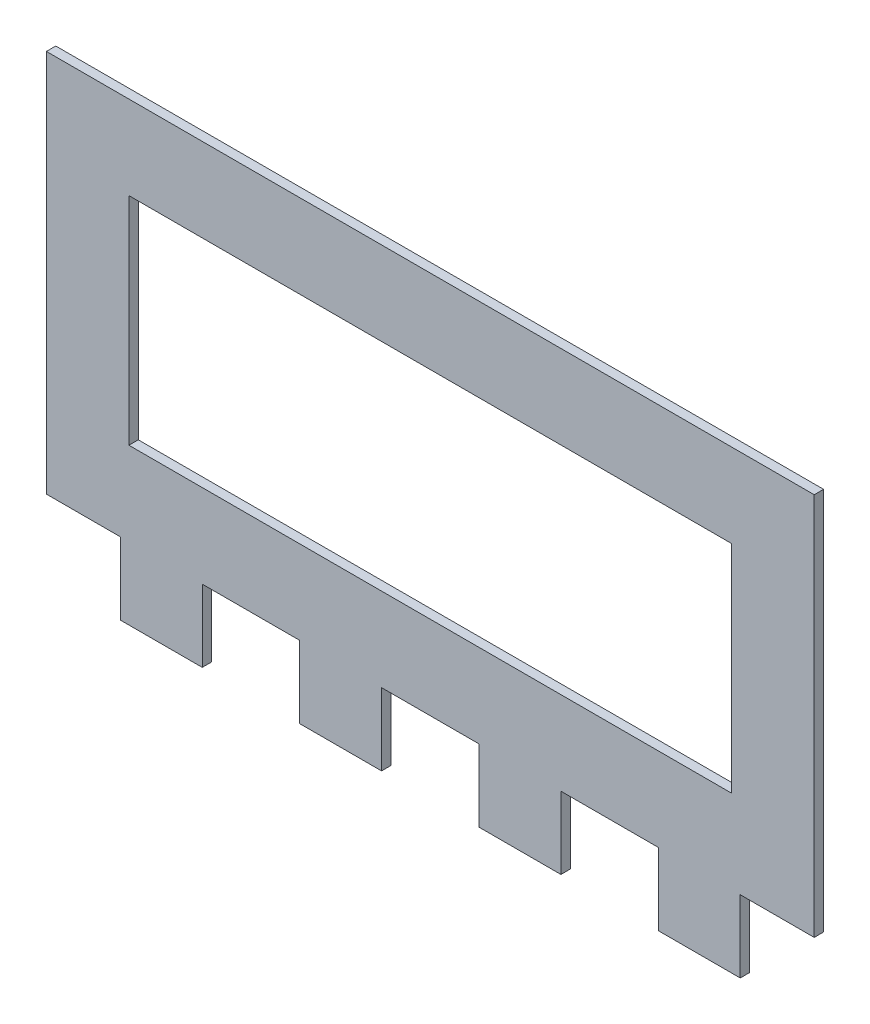
ISO-10303-21;
HEADER;
FILE_DESCRIPTION(('STEP AP214'),'2;1');
FILE_NAME('part.step','',(''),(''),'','','');
FILE_SCHEMA(('AUTOMOTIVE_DESIGN { 1 0 10303 214 1 1 1 1 }'));
ENDSEC;
DATA;
#1=APPLICATION_CONTEXT('core data for automotive mechanical design processes');
#2=APPLICATION_PROTOCOL_DEFINITION('international standard','automotive_design',2000,#1);
#3=PRODUCT_CONTEXT('',#1,'mechanical');
#4=PRODUCT('Part','Part','',(#3));
#5=PRODUCT_RELATED_PRODUCT_CATEGORY('part','',(#4));
#6=PRODUCT_DEFINITION_FORMATION('','',#4);
#7=PRODUCT_DEFINITION_CONTEXT('part definition',#1,'design');
#8=PRODUCT_DEFINITION('design','',#6,#7);
#9=PRODUCT_DEFINITION_SHAPE('','',#8);
#10=(LENGTH_UNIT() NAMED_UNIT(*) SI_UNIT(.MILLI.,.METRE.));
#11=(NAMED_UNIT(*) PLANE_ANGLE_UNIT() SI_UNIT($,.RADIAN.));
#12=(NAMED_UNIT(*) SI_UNIT($,.STERADIAN.) SOLID_ANGLE_UNIT());
#13=UNCERTAINTY_MEASURE_WITH_UNIT(LENGTH_MEASURE(1.E-05),#10,'distance_accuracy_value','');
#14=(GEOMETRIC_REPRESENTATION_CONTEXT(3) GLOBAL_UNCERTAINTY_ASSIGNED_CONTEXT((#13)) GLOBAL_UNIT_ASSIGNED_CONTEXT((#10,
#11,#12)) REPRESENTATION_CONTEXT('',''));
#15=CARTESIAN_POINT('',(0.,0.,0.));
#16=DIRECTION('',(0.,0.,1.));
#17=DIRECTION('',(1.,0.,0.));
#18=AXIS2_PLACEMENT_3D('',#15,#16,#17);
#19=CARTESIAN_POINT('',(0.299292489422655,-0.628720919475011,0.));
#20=DIRECTION('',(-1.,0.,0.));
#21=DIRECTION('',(0.,-1.,0.));
#22=AXIS2_PLACEMENT_3D('',#19,#20,#21);
#23=PLANE('',#22);
#24=DIRECTION('',(0.,-1.,0.));
#25=VECTOR('',#24,1.);
#26=CARTESIAN_POINT('',(0.299292489422655,-0.628720919475011,0.));
#27=LINE('',#26,#25);
#28=CARTESIAN_POINT('',(0.299292489422655,-0.628720919475011,0.));
#29=VERTEX_POINT('',#28);
#30=CARTESIAN_POINT('',(0.299292489422655,-0.697929145402712,0.));
#31=VERTEX_POINT('',#30);
#32=EDGE_CURVE('E11',#29,#31,#27,.T.);
#33=ORIENTED_EDGE('',*,*,#32,.T.);
#34=DIRECTION('',(0.,0.,1.));
#35=VECTOR('',#34,1.);
#36=CARTESIAN_POINT('',(0.299292489422655,-0.697929145402712,0.));
#37=LINE('',#36,#35);
#38=CARTESIAN_POINT('',(0.299292489422655,-0.697929145402712,0.003));
#39=VERTEX_POINT('',#38);
#40=EDGE_CURVE('E24',#31,#39,#37,.T.);
#41=ORIENTED_EDGE('',*,*,#40,.T.);
#42=DIRECTION('',(0.,-1.,0.));
#43=VECTOR('',#42,1.);
#44=CARTESIAN_POINT('',(0.299292489422655,-0.628720919475011,0.003));
#45=LINE('',#44,#43);
#46=CARTESIAN_POINT('',(0.299292489422655,-0.628720919475011,0.003));
#47=VERTEX_POINT('',#46);
#48=EDGE_CURVE('E388',#47,#39,#45,.T.);
#49=ORIENTED_EDGE('',*,*,#48,.F.);
#50=DIRECTION('',(0.,0.,1.));
#51=VECTOR('',#50,1.);
#52=CARTESIAN_POINT('',(0.299292489422655,-0.628720919475011,0.));
#53=LINE('',#52,#51);
#54=EDGE_CURVE('E385',#29,#47,#53,.T.);
#55=ORIENTED_EDGE('',*,*,#54,.F.);
#56=EDGE_LOOP('',(#33,#41,#49,#55));
#57=FACE_BOUND('',#56,.T.);
#58=ADVANCED_FACE('F17',(#57),#23,.T.);
#59=CARTESIAN_POINT('',(0.106314885062331,-0.628720919475011,0.));
#60=DIRECTION('',(0.,-1.,0.));
#61=DIRECTION('',(1.,0.,0.));
#62=AXIS2_PLACEMENT_3D('',#59,#60,#61);
#63=PLANE('',#62);
#64=DIRECTION('',(1.,0.,0.));
#65=VECTOR('',#64,1.);
#66=CARTESIAN_POINT('',(0.106314885062331,-0.628720919475011,0.));
#67=LINE('',#66,#65);
#68=CARTESIAN_POINT('',(0.106314885062331,-0.628720919475011,0.));
#69=VERTEX_POINT('',#68);
#70=EDGE_CURVE('E382',#69,#29,#67,.T.);
#71=ORIENTED_EDGE('',*,*,#70,.T.);
#72=ORIENTED_EDGE('',*,*,#54,.T.);
#73=DIRECTION('',(1.,0.,0.));
#74=VECTOR('',#73,1.);
#75=CARTESIAN_POINT('',(0.106314885062331,-0.628720919475011,0.003));
#76=LINE('',#75,#74);
#77=CARTESIAN_POINT('',(0.106314885062331,-0.628720919475011,0.003));
#78=VERTEX_POINT('',#77);
#79=EDGE_CURVE('E379',#78,#47,#76,.T.);
#80=ORIENTED_EDGE('',*,*,#79,.F.);
#81=DIRECTION('',(0.,0.,1.));
#82=VECTOR('',#81,1.);
#83=CARTESIAN_POINT('',(0.106314885062331,-0.628720919475011,0.));
#84=LINE('',#83,#82);
#85=EDGE_CURVE('E376',#69,#78,#84,.T.);
#86=ORIENTED_EDGE('',*,*,#85,.F.);
#87=EDGE_LOOP('',(#71,#72,#80,#86));
#88=FACE_BOUND('',#87,.T.);
#89=ADVANCED_FACE('F398',(#88),#63,.T.);
#90=CARTESIAN_POINT('',(0.106314885062331,-0.697929145402712,0.));
#91=DIRECTION('',(1.,0.,0.));
#92=DIRECTION('',(0.,1.,0.));
#93=AXIS2_PLACEMENT_3D('',#90,#91,#92);
#94=PLANE('',#93);
#95=DIRECTION('',(0.,1.,0.));
#96=VECTOR('',#95,1.);
#97=CARTESIAN_POINT('',(0.106314885062331,-0.697929145402712,0.));
#98=LINE('',#97,#96);
#99=CARTESIAN_POINT('',(0.106314885062331,-0.697929145402712,0.));
#100=VERTEX_POINT('',#99);
#101=EDGE_CURVE('E373',#100,#69,#98,.T.);
#102=ORIENTED_EDGE('',*,*,#101,.T.);
#103=ORIENTED_EDGE('',*,*,#85,.T.);
#104=DIRECTION('',(0.,1.,0.));
#105=VECTOR('',#104,1.);
#106=CARTESIAN_POINT('',(0.106314885062331,-0.697929145402712,0.003));
#107=LINE('',#106,#105);
#108=CARTESIAN_POINT('',(0.106314885062331,-0.697929145402712,0.003));
#109=VERTEX_POINT('',#108);
#110=EDGE_CURVE('E370',#109,#78,#107,.T.);
#111=ORIENTED_EDGE('',*,*,#110,.F.);
#112=DIRECTION('',(0.,0.,1.));
#113=VECTOR('',#112,1.);
#114=CARTESIAN_POINT('',(0.106314885062331,-0.697929145402712,0.));
#115=LINE('',#114,#113);
#116=EDGE_CURVE('E367',#100,#109,#115,.T.);
#117=ORIENTED_EDGE('',*,*,#116,.F.);
#118=EDGE_LOOP('',(#102,#103,#111,#117));
#119=FACE_BOUND('',#118,.T.);
#120=ADVANCED_FACE('F395',(#119),#94,.T.);
#121=CARTESIAN_POINT('',(0.299292489422655,-0.697929145402712,0.));
#122=DIRECTION('',(0.,1.,0.));
#123=DIRECTION('',(-1.,0.,0.));
#124=AXIS2_PLACEMENT_3D('',#121,#122,#123);
#125=PLANE('',#124);
#126=DIRECTION('',(-1.,0.,0.));
#127=VECTOR('',#126,1.);
#128=CARTESIAN_POINT('',(0.299292489422655,-0.697929145402712,0.));
#129=LINE('',#128,#127);
#130=EDGE_CURVE('E364',#31,#100,#129,.T.);
#131=ORIENTED_EDGE('',*,*,#130,.T.);
#132=ORIENTED_EDGE('',*,*,#116,.T.);
#133=DIRECTION('',(-1.,0.,0.));
#134=VECTOR('',#133,1.);
#135=CARTESIAN_POINT('',(0.299292489422655,-0.697929145402712,0.003));
#136=LINE('',#135,#134);
#137=EDGE_CURVE('E361',#39,#109,#136,.T.);
#138=ORIENTED_EDGE('',*,*,#137,.F.);
#139=ORIENTED_EDGE('',*,*,#40,.F.);
#140=EDGE_LOOP('',(#131,#132,#138,#139));
#141=FACE_BOUND('',#140,.T.);
#142=ADVANCED_FACE('F392',(#141),#125,.T.);
#143=CARTESIAN_POINT('',(0.129796845879691,-0.747783760491294,0.));
#144=DIRECTION('',(1.,0.,0.));
#145=DIRECTION('',(0.,1.,0.));
#146=AXIS2_PLACEMENT_3D('',#143,#144,#145);
#147=PLANE('',#146);
#148=DIRECTION('',(0.,1.,0.));
#149=VECTOR('',#148,1.);
#150=CARTESIAN_POINT('',(0.129796845879691,-0.747783760491294,0.));
#151=LINE('',#150,#149);
#152=CARTESIAN_POINT('',(0.129796845879691,-0.747783760491294,0.));
#153=VERTEX_POINT('',#152);
#154=CARTESIAN_POINT('',(0.129796845879691,-0.724695760491296,0.));
#155=VERTEX_POINT('',#154);
#156=EDGE_CURVE('E359',#153,#155,#151,.T.);
#157=ORIENTED_EDGE('',*,*,#156,.T.);
#158=DIRECTION('',(0.,0.,1.));
#159=VECTOR('',#158,1.);
#160=CARTESIAN_POINT('',(0.129796845879691,-0.724695760491296,0.));
#161=LINE('',#160,#159);
#162=CARTESIAN_POINT('',(0.129796845879691,-0.724695760491296,0.003));
#163=VERTEX_POINT('',#162);
#164=EDGE_CURVE('E357',#155,#163,#161,.T.);
#165=ORIENTED_EDGE('',*,*,#164,.T.);
#166=DIRECTION('',(0.,1.,0.));
#167=VECTOR('',#166,1.);
#168=CARTESIAN_POINT('',(0.129796845879691,-0.747783760491294,0.003));
#169=LINE('',#168,#167);
#170=CARTESIAN_POINT('',(0.129796845879691,-0.747783760491294,0.003));
#171=VERTEX_POINT('',#170);
#172=EDGE_CURVE('E199',#171,#163,#169,.T.);
#173=ORIENTED_EDGE('',*,*,#172,.F.);
#174=DIRECTION('',(0.,0.,1.));
#175=VECTOR('',#174,1.);
#176=CARTESIAN_POINT('',(0.129796845879691,-0.747783760491294,0.));
#177=LINE('',#176,#175);
#178=EDGE_CURVE('E353',#153,#171,#177,.T.);
#179=ORIENTED_EDGE('',*,*,#178,.F.);
#180=EDGE_LOOP('',(#157,#165,#173,#179));
#181=FACE_BOUND('',#180,.T.);
#182=ADVANCED_FACE('F419',(#181),#147,.T.);
#183=CARTESIAN_POINT('',(0.103586528605295,-0.747783760491294,0.));
#184=DIRECTION('',(0.,-1.,0.));
#185=DIRECTION('',(1.,0.,0.));
#186=AXIS2_PLACEMENT_3D('',#183,#184,#185);
#187=PLANE('',#186);
#188=DIRECTION('',(1.,0.,0.));
#189=VECTOR('',#188,1.);
#190=CARTESIAN_POINT('',(0.103586528605295,-0.747783760491294,0.));
#191=LINE('',#190,#189);
#192=CARTESIAN_POINT('',(0.103586528605295,-0.747783760491294,0.));
#193=VERTEX_POINT('',#192);
#194=EDGE_CURVE('E350',#193,#153,#191,.T.);
#195=ORIENTED_EDGE('',*,*,#194,.T.);
#196=ORIENTED_EDGE('',*,*,#178,.T.);
#197=DIRECTION('',(1.,0.,0.));
#198=VECTOR('',#197,1.);
#199=CARTESIAN_POINT('',(0.103586528605295,-0.747783760491294,0.003));
#200=LINE('',#199,#198);
#201=CARTESIAN_POINT('',(0.103586528605295,-0.747783760491294,0.003));
#202=VERTEX_POINT('',#201);
#203=EDGE_CURVE('E348',#202,#171,#200,.T.);
#204=ORIENTED_EDGE('',*,*,#203,.F.);
#205=DIRECTION('',(0.,0.,1.));
#206=VECTOR('',#205,1.);
#207=CARTESIAN_POINT('',(0.103586528605295,-0.747783760491294,0.));
#208=LINE('',#207,#206);
#209=EDGE_CURVE('E345',#193,#202,#208,.T.);
#210=ORIENTED_EDGE('',*,*,#209,.F.);
#211=EDGE_LOOP('',(#195,#196,#204,#210));
#212=FACE_BOUND('',#211,.T.);
#213=ADVANCED_FACE('F422',(#212),#187,.T.);
#214=CARTESIAN_POINT('',(0.103586528605295,-0.724695760491296,0.));
#215=DIRECTION('',(-1.,0.,0.));
#216=DIRECTION('',(0.,-1.,0.));
#217=AXIS2_PLACEMENT_3D('',#214,#215,#216);
#218=PLANE('',#217);
#219=DIRECTION('',(0.,-1.,0.));
#220=VECTOR('',#219,1.);
#221=CARTESIAN_POINT('',(0.103586528605295,-0.724695760491296,0.));
#222=LINE('',#221,#220);
#223=CARTESIAN_POINT('',(0.103586528605295,-0.724695760491296,0.));
#224=VERTEX_POINT('',#223);
#225=EDGE_CURVE('E342',#224,#193,#222,.T.);
#226=ORIENTED_EDGE('',*,*,#225,.T.);
#227=ORIENTED_EDGE('',*,*,#209,.T.);
#228=DIRECTION('',(0.,-1.,0.));
#229=VECTOR('',#228,1.);
#230=CARTESIAN_POINT('',(0.103586528605295,-0.724695760491296,0.003));
#231=LINE('',#230,#229);
#232=CARTESIAN_POINT('',(0.103586528605295,-0.724695760491296,0.003));
#233=VERTEX_POINT('',#232);
#234=EDGE_CURVE('E339',#233,#202,#231,.T.);
#235=ORIENTED_EDGE('',*,*,#234,.F.);
#236=DIRECTION('',(0.,0.,1.));
#237=VECTOR('',#236,1.);
#238=CARTESIAN_POINT('',(0.103586528605295,-0.724695760491296,0.));
#239=LINE('',#238,#237);
#240=EDGE_CURVE('E336',#224,#233,#239,.T.);
#241=ORIENTED_EDGE('',*,*,#240,.F.);
#242=EDGE_LOOP('',(#226,#227,#235,#241));
#243=FACE_BOUND('',#242,.T.);
#244=ADVANCED_FACE('F426',(#243),#218,.T.);
#245=CARTESIAN_POINT('',(0.0799016084450542,-0.724695760491296,0.));
#246=DIRECTION('',(0.,-1.,0.));
#247=DIRECTION('',(1.,0.,0.));
#248=AXIS2_PLACEMENT_3D('',#245,#246,#247);
#249=PLANE('',#248);
#250=DIRECTION('',(1.,0.,0.));
#251=VECTOR('',#250,1.);
#252=CARTESIAN_POINT('',(0.0799016084450542,-0.724695760491296,0.));
#253=LINE('',#252,#251);
#254=CARTESIAN_POINT('',(0.0799016084450542,-0.724695760491296,0.));
#255=VERTEX_POINT('',#254);
#256=EDGE_CURVE('E333',#255,#224,#253,.T.);
#257=ORIENTED_EDGE('',*,*,#256,.T.);
#258=ORIENTED_EDGE('',*,*,#240,.T.);
#259=DIRECTION('',(1.,0.,0.));
#260=VECTOR('',#259,1.);
#261=CARTESIAN_POINT('',(0.0799016084450542,-0.724695760491296,0.003));
#262=LINE('',#261,#260);
#263=CARTESIAN_POINT('',(0.0799016084450542,-0.724695760491296,0.003));
#264=VERTEX_POINT('',#263);
#265=EDGE_CURVE('E330',#264,#233,#262,.T.);
#266=ORIENTED_EDGE('',*,*,#265,.F.);
#267=DIRECTION('',(0.,0.,1.));
#268=VECTOR('',#267,1.);
#269=CARTESIAN_POINT('',(0.0799016084450542,-0.724695760491296,0.));
#270=LINE('',#269,#268);
#271=EDGE_CURVE('E327',#255,#264,#270,.T.);
#272=ORIENTED_EDGE('',*,*,#271,.F.);
#273=EDGE_LOOP('',(#257,#258,#266,#272));
#274=FACE_BOUND('',#273,.T.);
#275=ADVANCED_FACE('F430',(#274),#249,.T.);
#276=CARTESIAN_POINT('',(0.0799016084450542,-0.601954304386427,0.));
#277=DIRECTION('',(-1.,0.,0.));
#278=DIRECTION('',(0.,-1.,0.));
#279=AXIS2_PLACEMENT_3D('',#276,#277,#278);
#280=PLANE('',#279);
#281=DIRECTION('',(0.,-1.,0.));
#282=VECTOR('',#281,1.);
#283=CARTESIAN_POINT('',(0.0799016084450542,-0.601954304386427,0.));
#284=LINE('',#283,#282);
#285=CARTESIAN_POINT('',(0.0799016084450542,-0.601954304386427,0.));
#286=VERTEX_POINT('',#285);
#287=EDGE_CURVE('E324',#286,#255,#284,.T.);
#288=ORIENTED_EDGE('',*,*,#287,.T.);
#289=ORIENTED_EDGE('',*,*,#271,.T.);
#290=DIRECTION('',(0.,-1.,0.));
#291=VECTOR('',#290,1.);
#292=CARTESIAN_POINT('',(0.0799016084450542,-0.601954304386427,0.003));
#293=LINE('',#292,#291);
#294=CARTESIAN_POINT('',(0.0799016084450542,-0.601954304386427,0.003));
#295=VERTEX_POINT('',#294);
#296=EDGE_CURVE('E321',#295,#264,#293,.T.);
#297=ORIENTED_EDGE('',*,*,#296,.F.);
#298=DIRECTION('',(0.,0.,1.));
#299=VECTOR('',#298,1.);
#300=CARTESIAN_POINT('',(0.0799016084450542,-0.601954304386427,0.));
#301=LINE('',#300,#299);
#302=EDGE_CURVE('E318',#286,#295,#301,.T.);
#303=ORIENTED_EDGE('',*,*,#302,.F.);
#304=EDGE_LOOP('',(#288,#289,#297,#303));
#305=FACE_BOUND('',#304,.T.);
#306=ADVANCED_FACE('F434',(#305),#280,.T.);
#307=CARTESIAN_POINT('',(0.325705766039928,-0.601954304386427,0.));
#308=DIRECTION('',(0.,1.,0.));
#309=DIRECTION('',(-1.,0.,0.));
#310=AXIS2_PLACEMENT_3D('',#307,#308,#309);
#311=PLANE('',#310);
#312=DIRECTION('',(-1.,0.,0.));
#313=VECTOR('',#312,1.);
#314=CARTESIAN_POINT('',(0.325705766039928,-0.601954304386427,0.));
#315=LINE('',#314,#313);
#316=CARTESIAN_POINT('',(0.325705766039928,-0.601954304386427,0.));
#317=VERTEX_POINT('',#316);
#318=EDGE_CURVE('E315',#317,#286,#315,.T.);
#319=ORIENTED_EDGE('',*,*,#318,.T.);
#320=ORIENTED_EDGE('',*,*,#302,.T.);
#321=DIRECTION('',(-1.,0.,0.));
#322=VECTOR('',#321,1.);
#323=CARTESIAN_POINT('',(0.325705766039928,-0.601954304386427,0.003));
#324=LINE('',#323,#322);
#325=CARTESIAN_POINT('',(0.325705766039928,-0.601954304386427,0.003));
#326=VERTEX_POINT('',#325);
#327=EDGE_CURVE('E312',#326,#295,#324,.T.);
#328=ORIENTED_EDGE('',*,*,#327,.F.);
#329=DIRECTION('',(0.,0.,1.));
#330=VECTOR('',#329,1.);
#331=CARTESIAN_POINT('',(0.325705766039928,-0.601954304386427,0.));
#332=LINE('',#331,#330);
#333=EDGE_CURVE('E309',#317,#326,#332,.T.);
#334=ORIENTED_EDGE('',*,*,#333,.F.);
#335=EDGE_LOOP('',(#319,#320,#328,#334));
#336=FACE_BOUND('',#335,.T.);
#337=ADVANCED_FACE('F438',(#336),#311,.T.);
#338=CARTESIAN_POINT('',(0.325705766039928,-0.724695760491296,0.));
#339=DIRECTION('',(1.,0.,0.));
#340=DIRECTION('',(0.,1.,0.));
#341=AXIS2_PLACEMENT_3D('',#338,#339,#340);
#342=PLANE('',#341);
#343=DIRECTION('',(0.,1.,0.));
#344=VECTOR('',#343,1.);
#345=CARTESIAN_POINT('',(0.325705766039928,-0.724695760491296,0.));
#346=LINE('',#345,#344);
#347=CARTESIAN_POINT('',(0.325705766039928,-0.724695760491296,0.));
#348=VERTEX_POINT('',#347);
#349=EDGE_CURVE('E306',#348,#317,#346,.T.);
#350=ORIENTED_EDGE('',*,*,#349,.T.);
#351=ORIENTED_EDGE('',*,*,#333,.T.);
#352=DIRECTION('',(0.,1.,0.));
#353=VECTOR('',#352,1.);
#354=CARTESIAN_POINT('',(0.325705766039928,-0.724695760491296,0.003));
#355=LINE('',#354,#353);
#356=CARTESIAN_POINT('',(0.325705766039928,-0.724695760491296,0.003));
#357=VERTEX_POINT('',#356);
#358=EDGE_CURVE('E303',#357,#326,#355,.T.);
#359=ORIENTED_EDGE('',*,*,#358,.F.);
#360=DIRECTION('',(0.,0.,1.));
#361=VECTOR('',#360,1.);
#362=CARTESIAN_POINT('',(0.325705766039928,-0.724695760491296,0.));
#363=LINE('',#362,#361);
#364=EDGE_CURVE('E300',#348,#357,#363,.T.);
#365=ORIENTED_EDGE('',*,*,#364,.F.);
#366=EDGE_LOOP('',(#350,#351,#359,#365));
#367=FACE_BOUND('',#366,.T.);
#368=ADVANCED_FACE('F442',(#367),#342,.T.);
#369=CARTESIAN_POINT('',(0.302020845879691,-0.724695760491296,0.));
#370=DIRECTION('',(0.,-1.,0.));
#371=DIRECTION('',(1.,0.,0.));
#372=AXIS2_PLACEMENT_3D('',#369,#370,#371);
#373=PLANE('',#372);
#374=DIRECTION('',(1.,0.,0.));
#375=VECTOR('',#374,1.);
#376=CARTESIAN_POINT('',(0.302020845879691,-0.724695760491296,0.));
#377=LINE('',#376,#375);
#378=CARTESIAN_POINT('',(0.302020845879691,-0.724695760491296,0.));
#379=VERTEX_POINT('',#378);
#380=EDGE_CURVE('E297',#379,#348,#377,.T.);
#381=ORIENTED_EDGE('',*,*,#380,.T.);
#382=ORIENTED_EDGE('',*,*,#364,.T.);
#383=DIRECTION('',(1.,0.,0.));
#384=VECTOR('',#383,1.);
#385=CARTESIAN_POINT('',(0.302020845879691,-0.724695760491296,0.003));
#386=LINE('',#385,#384);
#387=CARTESIAN_POINT('',(0.302020845879691,-0.724695760491296,0.003));
#388=VERTEX_POINT('',#387);
#389=EDGE_CURVE('E294',#388,#357,#386,.T.);
#390=ORIENTED_EDGE('',*,*,#389,.F.);
#391=DIRECTION('',(0.,0.,1.));
#392=VECTOR('',#391,1.);
#393=CARTESIAN_POINT('',(0.302020845879691,-0.724695760491296,0.));
#394=LINE('',#393,#392);
#395=EDGE_CURVE('E291',#379,#388,#394,.T.);
#396=ORIENTED_EDGE('',*,*,#395,.F.);
#397=EDGE_LOOP('',(#381,#382,#390,#396));
#398=FACE_BOUND('',#397,.T.);
#399=ADVANCED_FACE('F446',(#398),#373,.T.);
#400=CARTESIAN_POINT('',(0.302020845879691,-0.747783760491294,0.));
#401=DIRECTION('',(1.,0.,0.));
#402=DIRECTION('',(0.,1.,0.));
#403=AXIS2_PLACEMENT_3D('',#400,#401,#402);
#404=PLANE('',#403);
#405=DIRECTION('',(0.,1.,0.));
#406=VECTOR('',#405,1.);
#407=CARTESIAN_POINT('',(0.302020845879691,-0.747783760491294,0.));
#408=LINE('',#407,#406);
#409=CARTESIAN_POINT('',(0.302020845879691,-0.747783760491294,0.));
#410=VERTEX_POINT('',#409);
#411=EDGE_CURVE('E288',#410,#379,#408,.T.);
#412=ORIENTED_EDGE('',*,*,#411,.T.);
#413=ORIENTED_EDGE('',*,*,#395,.T.);
#414=DIRECTION('',(0.,1.,0.));
#415=VECTOR('',#414,1.);
#416=CARTESIAN_POINT('',(0.302020845879691,-0.747783760491294,0.003));
#417=LINE('',#416,#415);
#418=CARTESIAN_POINT('',(0.302020845879691,-0.747783760491294,0.003));
#419=VERTEX_POINT('',#418);
#420=EDGE_CURVE('E285',#419,#388,#417,.T.);
#421=ORIENTED_EDGE('',*,*,#420,.F.);
#422=DIRECTION('',(0.,0.,1.));
#423=VECTOR('',#422,1.);
#424=CARTESIAN_POINT('',(0.302020845879691,-0.747783760491294,0.));
#425=LINE('',#424,#423);
#426=EDGE_CURVE('E282',#410,#419,#425,.T.);
#427=ORIENTED_EDGE('',*,*,#426,.F.);
#428=EDGE_LOOP('',(#412,#413,#421,#427));
#429=FACE_BOUND('',#428,.T.);
#430=ADVANCED_FACE('F450',(#429),#404,.T.);
#431=CARTESIAN_POINT('',(0.275810528605295,-0.747783760491294,0.));
#432=DIRECTION('',(0.,-1.,0.));
#433=DIRECTION('',(1.,0.,0.));
#434=AXIS2_PLACEMENT_3D('',#431,#432,#433);
#435=PLANE('',#434);
#436=DIRECTION('',(1.,0.,0.));
#437=VECTOR('',#436,1.);
#438=CARTESIAN_POINT('',(0.275810528605295,-0.747783760491294,0.));
#439=LINE('',#438,#437);
#440=CARTESIAN_POINT('',(0.275810528605295,-0.747783760491294,0.));
#441=VERTEX_POINT('',#440);
#442=EDGE_CURVE('E279',#441,#410,#439,.T.);
#443=ORIENTED_EDGE('',*,*,#442,.T.);
#444=ORIENTED_EDGE('',*,*,#426,.T.);
#445=DIRECTION('',(1.,0.,0.));
#446=VECTOR('',#445,1.);
#447=CARTESIAN_POINT('',(0.275810528605295,-0.747783760491294,0.003));
#448=LINE('',#447,#446);
#449=CARTESIAN_POINT('',(0.275810528605295,-0.747783760491294,0.003));
#450=VERTEX_POINT('',#449);
#451=EDGE_CURVE('E276',#450,#419,#448,.T.);
#452=ORIENTED_EDGE('',*,*,#451,.F.);
#453=DIRECTION('',(0.,0.,1.));
#454=VECTOR('',#453,1.);
#455=CARTESIAN_POINT('',(0.275810528605295,-0.747783760491294,0.));
#456=LINE('',#455,#454);
#457=EDGE_CURVE('E273',#441,#450,#456,.T.);
#458=ORIENTED_EDGE('',*,*,#457,.F.);
#459=EDGE_LOOP('',(#443,#444,#452,#458));
#460=FACE_BOUND('',#459,.T.);
#461=ADVANCED_FACE('F454',(#460),#435,.T.);
#462=CARTESIAN_POINT('',(0.275810528605295,-0.724695760491296,0.));
#463=DIRECTION('',(-1.,0.,0.));
#464=DIRECTION('',(0.,-1.,0.));
#465=AXIS2_PLACEMENT_3D('',#462,#463,#464);
#466=PLANE('',#465);
#467=DIRECTION('',(0.,-1.,0.));
#468=VECTOR('',#467,1.);
#469=CARTESIAN_POINT('',(0.275810528605295,-0.724695760491296,0.));
#470=LINE('',#469,#468);
#471=CARTESIAN_POINT('',(0.275810528605295,-0.724695760491296,0.));
#472=VERTEX_POINT('',#471);
#473=EDGE_CURVE('E270',#472,#441,#470,.T.);
#474=ORIENTED_EDGE('',*,*,#473,.T.);
#475=ORIENTED_EDGE('',*,*,#457,.T.);
#476=DIRECTION('',(0.,-1.,0.));
#477=VECTOR('',#476,1.);
#478=CARTESIAN_POINT('',(0.275810528605295,-0.724695760491296,0.003));
#479=LINE('',#478,#477);
#480=CARTESIAN_POINT('',(0.275810528605295,-0.724695760491296,0.003));
#481=VERTEX_POINT('',#480);
#482=EDGE_CURVE('E267',#481,#450,#479,.T.);
#483=ORIENTED_EDGE('',*,*,#482,.F.);
#484=DIRECTION('',(0.,0.,1.));
#485=VECTOR('',#484,1.);
#486=CARTESIAN_POINT('',(0.275810528605295,-0.724695760491296,0.));
#487=LINE('',#486,#485);
#488=EDGE_CURVE('E264',#472,#481,#487,.T.);
#489=ORIENTED_EDGE('',*,*,#488,.F.);
#490=EDGE_LOOP('',(#474,#475,#483,#489));
#491=FACE_BOUND('',#490,.T.);
#492=ADVANCED_FACE('F458',(#491),#466,.T.);
#493=CARTESIAN_POINT('',(0.244612845879688,-0.724695760491296,0.));
#494=DIRECTION('',(0.,-1.,0.));
#495=DIRECTION('',(1.,0.,0.));
#496=AXIS2_PLACEMENT_3D('',#493,#494,#495);
#497=PLANE('',#496);
#498=DIRECTION('',(1.,0.,0.));
#499=VECTOR('',#498,1.);
#500=CARTESIAN_POINT('',(0.244612845879688,-0.724695760491296,0.));
#501=LINE('',#500,#499);
#502=CARTESIAN_POINT('',(0.244612845879688,-0.724695760491296,0.));
#503=VERTEX_POINT('',#502);
#504=EDGE_CURVE('E261',#503,#472,#501,.T.);
#505=ORIENTED_EDGE('',*,*,#504,.T.);
#506=ORIENTED_EDGE('',*,*,#488,.T.);
#507=DIRECTION('',(1.,0.,0.));
#508=VECTOR('',#507,1.);
#509=CARTESIAN_POINT('',(0.244612845879688,-0.724695760491296,0.003));
#510=LINE('',#509,#508);
#511=CARTESIAN_POINT('',(0.244612845879688,-0.724695760491296,0.003));
#512=VERTEX_POINT('',#511);
#513=EDGE_CURVE('E258',#512,#481,#510,.T.);
#514=ORIENTED_EDGE('',*,*,#513,.F.);
#515=DIRECTION('',(0.,0.,1.));
#516=VECTOR('',#515,1.);
#517=CARTESIAN_POINT('',(0.244612845879688,-0.724695760491296,0.));
#518=LINE('',#517,#516);
#519=EDGE_CURVE('E255',#503,#512,#518,.T.);
#520=ORIENTED_EDGE('',*,*,#519,.F.);
#521=EDGE_LOOP('',(#505,#506,#514,#520));
#522=FACE_BOUND('',#521,.T.);
#523=ADVANCED_FACE('F462',(#522),#497,.T.);
#524=CARTESIAN_POINT('',(0.244612845879688,-0.747783760491294,0.));
#525=DIRECTION('',(1.,0.,0.));
#526=DIRECTION('',(0.,1.,0.));
#527=AXIS2_PLACEMENT_3D('',#524,#525,#526);
#528=PLANE('',#527);
#529=DIRECTION('',(0.,1.,0.));
#530=VECTOR('',#529,1.);
#531=CARTESIAN_POINT('',(0.244612845879688,-0.747783760491294,0.));
#532=LINE('',#531,#530);
#533=CARTESIAN_POINT('',(0.244612845879688,-0.747783760491294,0.));
#534=VERTEX_POINT('',#533);
#535=EDGE_CURVE('E252',#534,#503,#532,.T.);
#536=ORIENTED_EDGE('',*,*,#535,.T.);
#537=ORIENTED_EDGE('',*,*,#519,.T.);
#538=DIRECTION('',(0.,1.,0.));
#539=VECTOR('',#538,1.);
#540=CARTESIAN_POINT('',(0.244612845879688,-0.747783760491294,0.003));
#541=LINE('',#540,#539);
#542=CARTESIAN_POINT('',(0.244612845879688,-0.747783760491294,0.003));
#543=VERTEX_POINT('',#542);
#544=EDGE_CURVE('E249',#543,#512,#541,.T.);
#545=ORIENTED_EDGE('',*,*,#544,.F.);
#546=DIRECTION('',(0.,0.,1.));
#547=VECTOR('',#546,1.);
#548=CARTESIAN_POINT('',(0.244612845879688,-0.747783760491294,0.));
#549=LINE('',#548,#547);
#550=EDGE_CURVE('E246',#534,#543,#549,.T.);
#551=ORIENTED_EDGE('',*,*,#550,.F.);
#552=EDGE_LOOP('',(#536,#537,#545,#551));
#553=FACE_BOUND('',#552,.T.);
#554=ADVANCED_FACE('F466',(#553),#528,.T.);
#555=CARTESIAN_POINT('',(0.218402528605293,-0.747783760491294,0.));
#556=DIRECTION('',(0.,-1.,0.));
#557=DIRECTION('',(1.,0.,0.));
#558=AXIS2_PLACEMENT_3D('',#555,#556,#557);
#559=PLANE('',#558);
#560=DIRECTION('',(1.,0.,0.));
#561=VECTOR('',#560,1.);
#562=CARTESIAN_POINT('',(0.218402528605293,-0.747783760491294,0.));
#563=LINE('',#562,#561);
#564=CARTESIAN_POINT('',(0.218402528605293,-0.747783760491294,0.));
#565=VERTEX_POINT('',#564);
#566=EDGE_CURVE('E243',#565,#534,#563,.T.);
#567=ORIENTED_EDGE('',*,*,#566,.T.);
#568=ORIENTED_EDGE('',*,*,#550,.T.);
#569=DIRECTION('',(1.,0.,0.));
#570=VECTOR('',#569,1.);
#571=CARTESIAN_POINT('',(0.218402528605293,-0.747783760491294,0.003));
#572=LINE('',#571,#570);
#573=CARTESIAN_POINT('',(0.218402528605293,-0.747783760491294,0.003));
#574=VERTEX_POINT('',#573);
#575=EDGE_CURVE('E240',#574,#543,#572,.T.);
#576=ORIENTED_EDGE('',*,*,#575,.F.);
#577=DIRECTION('',(0.,0.,1.));
#578=VECTOR('',#577,1.);
#579=CARTESIAN_POINT('',(0.218402528605293,-0.747783760491294,0.));
#580=LINE('',#579,#578);
#581=EDGE_CURVE('E237',#565,#574,#580,.T.);
#582=ORIENTED_EDGE('',*,*,#581,.F.);
#583=EDGE_LOOP('',(#567,#568,#576,#582));
#584=FACE_BOUND('',#583,.T.);
#585=ADVANCED_FACE('F470',(#584),#559,.T.);
#586=CARTESIAN_POINT('',(0.218402528605293,-0.724695760491296,0.));
#587=DIRECTION('',(-1.,0.,0.));
#588=DIRECTION('',(0.,-1.,0.));
#589=AXIS2_PLACEMENT_3D('',#586,#587,#588);
#590=PLANE('',#589);
#591=DIRECTION('',(0.,-1.,0.));
#592=VECTOR('',#591,1.);
#593=CARTESIAN_POINT('',(0.218402528605293,-0.724695760491296,0.));
#594=LINE('',#593,#592);
#595=CARTESIAN_POINT('',(0.218402528605293,-0.724695760491296,0.));
#596=VERTEX_POINT('',#595);
#597=EDGE_CURVE('E234',#596,#565,#594,.T.);
#598=ORIENTED_EDGE('',*,*,#597,.T.);
#599=ORIENTED_EDGE('',*,*,#581,.T.);
#600=DIRECTION('',(0.,-1.,0.));
#601=VECTOR('',#600,1.);
#602=CARTESIAN_POINT('',(0.218402528605293,-0.724695760491296,0.003));
#603=LINE('',#602,#601);
#604=CARTESIAN_POINT('',(0.218402528605293,-0.724695760491296,0.003));
#605=VERTEX_POINT('',#604);
#606=EDGE_CURVE('E231',#605,#574,#603,.T.);
#607=ORIENTED_EDGE('',*,*,#606,.F.);
#608=DIRECTION('',(0.,0.,1.));
#609=VECTOR('',#608,1.);
#610=CARTESIAN_POINT('',(0.218402528605293,-0.724695760491296,0.));
#611=LINE('',#610,#609);
#612=EDGE_CURVE('E228',#596,#605,#611,.T.);
#613=ORIENTED_EDGE('',*,*,#612,.F.);
#614=EDGE_LOOP('',(#598,#599,#607,#613));
#615=FACE_BOUND('',#614,.T.);
#616=ADVANCED_FACE('F474',(#615),#590,.T.);
#617=CARTESIAN_POINT('',(0.187204845879693,-0.724695760491296,0.));
#618=DIRECTION('',(0.,-1.,0.));
#619=DIRECTION('',(1.,0.,0.));
#620=AXIS2_PLACEMENT_3D('',#617,#618,#619);
#621=PLANE('',#620);
#622=DIRECTION('',(1.,0.,0.));
#623=VECTOR('',#622,1.);
#624=CARTESIAN_POINT('',(0.187204845879693,-0.724695760491296,0.));
#625=LINE('',#624,#623);
#626=CARTESIAN_POINT('',(0.187204845879693,-0.724695760491296,0.));
#627=VERTEX_POINT('',#626);
#628=EDGE_CURVE('E225',#627,#596,#625,.T.);
#629=ORIENTED_EDGE('',*,*,#628,.T.);
#630=ORIENTED_EDGE('',*,*,#612,.T.);
#631=DIRECTION('',(1.,0.,0.));
#632=VECTOR('',#631,1.);
#633=CARTESIAN_POINT('',(0.187204845879693,-0.724695760491296,0.003));
#634=LINE('',#633,#632);
#635=CARTESIAN_POINT('',(0.187204845879693,-0.724695760491296,0.003));
#636=VERTEX_POINT('',#635);
#637=EDGE_CURVE('E222',#636,#605,#634,.T.);
#638=ORIENTED_EDGE('',*,*,#637,.F.);
#639=DIRECTION('',(0.,0.,1.));
#640=VECTOR('',#639,1.);
#641=CARTESIAN_POINT('',(0.187204845879693,-0.724695760491296,0.));
#642=LINE('',#641,#640);
#643=EDGE_CURVE('E219',#627,#636,#642,.T.);
#644=ORIENTED_EDGE('',*,*,#643,.F.);
#645=EDGE_LOOP('',(#629,#630,#638,#644));
#646=FACE_BOUND('',#645,.T.);
#647=ADVANCED_FACE('F478',(#646),#621,.T.);
#648=CARTESIAN_POINT('',(0.187204845879693,-0.747783760491294,0.));
#649=DIRECTION('',(1.,0.,0.));
#650=DIRECTION('',(0.,1.,0.));
#651=AXIS2_PLACEMENT_3D('',#648,#649,#650);
#652=PLANE('',#651);
#653=DIRECTION('',(0.,1.,0.));
#654=VECTOR('',#653,1.);
#655=CARTESIAN_POINT('',(0.187204845879693,-0.747783760491294,0.));
#656=LINE('',#655,#654);
#657=CARTESIAN_POINT('',(0.187204845879693,-0.747783760491294,0.));
#658=VERTEX_POINT('',#657);
#659=EDGE_CURVE('E216',#658,#627,#656,.T.);
#660=ORIENTED_EDGE('',*,*,#659,.T.);
#661=ORIENTED_EDGE('',*,*,#643,.T.);
#662=DIRECTION('',(0.,1.,0.));
#663=VECTOR('',#662,1.);
#664=CARTESIAN_POINT('',(0.187204845879693,-0.747783760491294,0.003));
#665=LINE('',#664,#663);
#666=CARTESIAN_POINT('',(0.187204845879693,-0.747783760491294,0.003));
#667=VERTEX_POINT('',#666);
#668=EDGE_CURVE('E213',#667,#636,#665,.T.);
#669=ORIENTED_EDGE('',*,*,#668,.F.);
#670=DIRECTION('',(0.,0.,1.));
#671=VECTOR('',#670,1.);
#672=CARTESIAN_POINT('',(0.187204845879693,-0.747783760491294,0.));
#673=LINE('',#672,#671);
#674=EDGE_CURVE('E210',#658,#667,#673,.T.);
#675=ORIENTED_EDGE('',*,*,#674,.F.);
#676=EDGE_LOOP('',(#660,#661,#669,#675));
#677=FACE_BOUND('',#676,.T.);
#678=ADVANCED_FACE('F482',(#677),#652,.T.);
#679=CARTESIAN_POINT('',(0.160994528605291,-0.747783760491294,0.));
#680=DIRECTION('',(0.,-1.,0.));
#681=DIRECTION('',(1.,0.,0.));
#682=AXIS2_PLACEMENT_3D('',#679,#680,#681);
#683=PLANE('',#682);
#684=DIRECTION('',(1.,0.,0.));
#685=VECTOR('',#684,1.);
#686=CARTESIAN_POINT('',(0.160994528605291,-0.747783760491294,0.));
#687=LINE('',#686,#685);
#688=CARTESIAN_POINT('',(0.160994528605291,-0.747783760491294,0.));
#689=VERTEX_POINT('',#688);
#690=EDGE_CURVE('E207',#689,#658,#687,.T.);
#691=ORIENTED_EDGE('',*,*,#690,.T.);
#692=ORIENTED_EDGE('',*,*,#674,.T.);
#693=DIRECTION('',(1.,0.,0.));
#694=VECTOR('',#693,1.);
#695=CARTESIAN_POINT('',(0.160994528605291,-0.747783760491294,0.003));
#696=LINE('',#695,#694);
#697=CARTESIAN_POINT('',(0.160994528605291,-0.747783760491294,0.003));
#698=VERTEX_POINT('',#697);
#699=EDGE_CURVE('E205',#698,#667,#696,.T.);
#700=ORIENTED_EDGE('',*,*,#699,.F.);
#701=DIRECTION('',(0.,0.,1.));
#702=VECTOR('',#701,1.);
#703=CARTESIAN_POINT('',(0.160994528605291,-0.747783760491294,0.));
#704=LINE('',#703,#702);
#705=EDGE_CURVE('E181',#689,#698,#704,.T.);
#706=ORIENTED_EDGE('',*,*,#705,.F.);
#707=EDGE_LOOP('',(#691,#692,#700,#706));
#708=FACE_BOUND('',#707,.T.);
#709=ADVANCED_FACE('F486',(#708),#683,.T.);
#710=CARTESIAN_POINT('',(0.160994528605291,-0.724695760491296,0.));
#711=DIRECTION('',(-1.,0.,0.));
#712=DIRECTION('',(0.,-1.,0.));
#713=AXIS2_PLACEMENT_3D('',#710,#711,#712);
#714=PLANE('',#713);
#715=DIRECTION('',(0.,-1.,0.));
#716=VECTOR('',#715,1.);
#717=CARTESIAN_POINT('',(0.160994528605291,-0.724695760491296,0.));
#718=LINE('',#717,#716);
#719=CARTESIAN_POINT('',(0.160994528605291,-0.724695760491296,0.));
#720=VERTEX_POINT('',#719);
#721=EDGE_CURVE('E185',#720,#689,#718,.T.);
#722=ORIENTED_EDGE('',*,*,#721,.T.);
#723=ORIENTED_EDGE('',*,*,#705,.T.);
#724=DIRECTION('',(0.,-1.,0.));
#725=VECTOR('',#724,1.);
#726=CARTESIAN_POINT('',(0.160994528605291,-0.724695760491296,0.003));
#727=LINE('',#726,#725);
#728=CARTESIAN_POINT('',(0.160994528605291,-0.724695760491296,0.003));
#729=VERTEX_POINT('',#728);
#730=EDGE_CURVE('E174',#729,#698,#727,.T.);
#731=ORIENTED_EDGE('',*,*,#730,.F.);
#732=DIRECTION('',(0.,0.,1.));
#733=VECTOR('',#732,1.);
#734=CARTESIAN_POINT('',(0.160994528605291,-0.724695760491296,0.));
#735=LINE('',#734,#733);
#736=EDGE_CURVE('E178',#720,#729,#735,.T.);
#737=ORIENTED_EDGE('',*,*,#736,.F.);
#738=EDGE_LOOP('',(#722,#723,#731,#737));
#739=FACE_BOUND('',#738,.T.);
#740=ADVANCED_FACE('F177',(#739),#714,.T.);
#741=CARTESIAN_POINT('',(0.129796845879691,-0.724695760491296,0.));
#742=DIRECTION('',(0.,-1.,0.));
#743=DIRECTION('',(1.,0.,0.));
#744=AXIS2_PLACEMENT_3D('',#741,#742,#743);
#745=PLANE('',#744);
#746=DIRECTION('',(1.,0.,0.));
#747=VECTOR('',#746,1.);
#748=CARTESIAN_POINT('',(0.129796845879691,-0.724695760491296,0.));
#749=LINE('',#748,#747);
#750=EDGE_CURVE('E193',#155,#720,#749,.T.);
#751=ORIENTED_EDGE('',*,*,#750,.T.);
#752=ORIENTED_EDGE('',*,*,#736,.T.);
#753=DIRECTION('',(1.,0.,0.));
#754=VECTOR('',#753,1.);
#755=CARTESIAN_POINT('',(0.129796845879691,-0.724695760491296,0.003));
#756=LINE('',#755,#754);
#757=EDGE_CURVE('E191',#163,#729,#756,.T.);
#758=ORIENTED_EDGE('',*,*,#757,.F.);
#759=ORIENTED_EDGE('',*,*,#164,.F.);
#760=EDGE_LOOP('',(#751,#752,#758,#759));
#761=FACE_BOUND('',#760,.T.);
#762=ADVANCED_FACE('F189',(#761),#745,.T.);
#763=CARTESIAN_POINT('',(0.202803687242491,-0.674869032438861,0.003));
#764=DIRECTION('',(0.,0.,1.));
#765=DIRECTION('',(1.,0.,0.));
#766=AXIS2_PLACEMENT_3D('',#763,#764,#765);
#767=PLANE('',#766);
#768=ORIENTED_EDGE('',*,*,#757,.T.);
#769=ORIENTED_EDGE('',*,*,#730,.T.);
#770=ORIENTED_EDGE('',*,*,#699,.T.);
#771=ORIENTED_EDGE('',*,*,#668,.T.);
#772=ORIENTED_EDGE('',*,*,#637,.T.);
#773=ORIENTED_EDGE('',*,*,#606,.T.);
#774=ORIENTED_EDGE('',*,*,#575,.T.);
#775=ORIENTED_EDGE('',*,*,#544,.T.);
#776=ORIENTED_EDGE('',*,*,#513,.T.);
#777=ORIENTED_EDGE('',*,*,#482,.T.);
#778=ORIENTED_EDGE('',*,*,#451,.T.);
#779=ORIENTED_EDGE('',*,*,#420,.T.);
#780=ORIENTED_EDGE('',*,*,#389,.T.);
#781=ORIENTED_EDGE('',*,*,#358,.T.);
#782=ORIENTED_EDGE('',*,*,#327,.T.);
#783=ORIENTED_EDGE('',*,*,#296,.T.);
#784=ORIENTED_EDGE('',*,*,#265,.T.);
#785=ORIENTED_EDGE('',*,*,#234,.T.);
#786=ORIENTED_EDGE('',*,*,#203,.T.);
#787=ORIENTED_EDGE('',*,*,#172,.T.);
#788=EDGE_LOOP('',(#768,#769,#770,#771,#772,#773,#774,#775,#776,#777,#778,#779,#780,#781,#782,
#783,#784,#785,#786,#787));
#789=FACE_BOUND('',#788,.T.);
#790=ORIENTED_EDGE('',*,*,#137,.T.);
#791=ORIENTED_EDGE('',*,*,#110,.T.);
#792=ORIENTED_EDGE('',*,*,#79,.T.);
#793=ORIENTED_EDGE('',*,*,#48,.T.);
#794=EDGE_LOOP('',(#790,#791,#792,#793));
#795=FACE_BOUND('',#794,.T.);
#796=ADVANCED_FACE('F196',(#789,#795),#767,.T.);
#797=CARTESIAN_POINT('',(0.202803687242491,-0.674869032438861,0.));
#798=DIRECTION('',(0.,0.,1.));
#799=DIRECTION('',(1.,0.,0.));
#800=AXIS2_PLACEMENT_3D('',#797,#798,#799);
#801=PLANE('',#800);
#802=ORIENTED_EDGE('',*,*,#750,.F.);
#803=ORIENTED_EDGE('',*,*,#156,.F.);
#804=ORIENTED_EDGE('',*,*,#194,.F.);
#805=ORIENTED_EDGE('',*,*,#225,.F.);
#806=ORIENTED_EDGE('',*,*,#256,.F.);
#807=ORIENTED_EDGE('',*,*,#287,.F.);
#808=ORIENTED_EDGE('',*,*,#318,.F.);
#809=ORIENTED_EDGE('',*,*,#349,.F.);
#810=ORIENTED_EDGE('',*,*,#380,.F.);
#811=ORIENTED_EDGE('',*,*,#411,.F.);
#812=ORIENTED_EDGE('',*,*,#442,.F.);
#813=ORIENTED_EDGE('',*,*,#473,.F.);
#814=ORIENTED_EDGE('',*,*,#504,.F.);
#815=ORIENTED_EDGE('',*,*,#535,.F.);
#816=ORIENTED_EDGE('',*,*,#566,.F.);
#817=ORIENTED_EDGE('',*,*,#597,.F.);
#818=ORIENTED_EDGE('',*,*,#628,.F.);
#819=ORIENTED_EDGE('',*,*,#659,.F.);
#820=ORIENTED_EDGE('',*,*,#690,.F.);
#821=ORIENTED_EDGE('',*,*,#721,.F.);
#822=EDGE_LOOP('',(#802,#803,#804,#805,#806,#807,#808,#809,#810,#811,#812,#813,#814,#815,#816,
#817,#818,#819,#820,#821));
#823=FACE_BOUND('',#822,.T.);
#824=ORIENTED_EDGE('',*,*,#130,.F.);
#825=ORIENTED_EDGE('',*,*,#32,.F.);
#826=ORIENTED_EDGE('',*,*,#70,.F.);
#827=ORIENTED_EDGE('',*,*,#101,.F.);
#828=EDGE_LOOP('',(#824,#825,#826,#827));
#829=FACE_BOUND('',#828,.T.);
#830=ADVANCED_FACE('F399',(#823,#829),#801,.F.);
#831=CLOSED_SHELL('',(#58,#89,#120,#142,#182,#213,#244,#275,#306,#337,#368,#399,#430,#461,#492,
#523,#554,#585,#616,#647,#678,#709,#740,#762,#796,#830));
#832=MANIFOLD_SOLID_BREP('B1',#831);
#833=ADVANCED_BREP_SHAPE_REPRESENTATION('',(#18,#832),#14);
#834=SHAPE_DEFINITION_REPRESENTATION(#9,#833);
ENDSEC;
END-ISO-10303-21;
